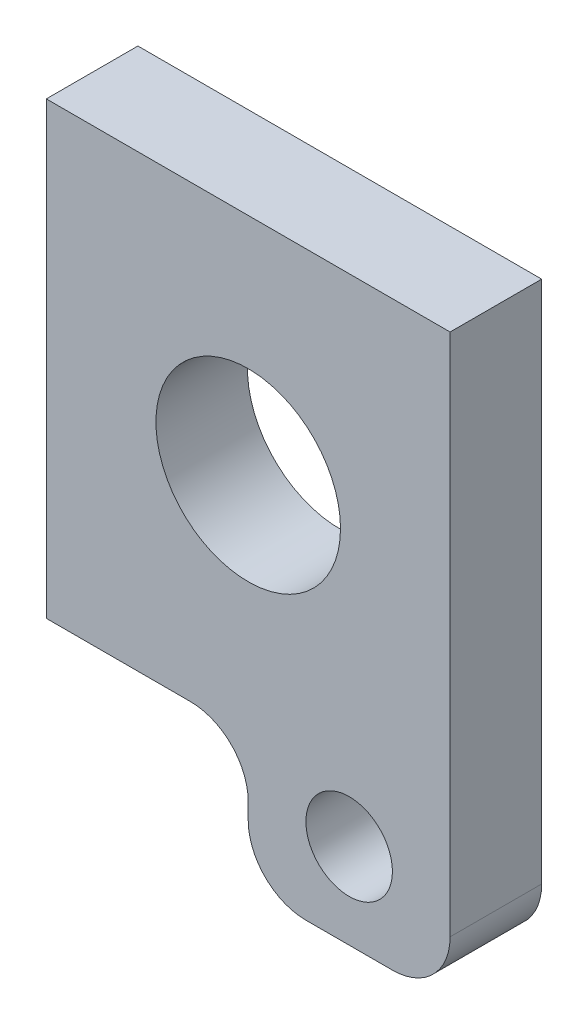
ISO-10303-21;
HEADER;
FILE_DESCRIPTION(('STEP AP214'),'2;1');
FILE_NAME('part.step','',(''),(''),'','','');
FILE_SCHEMA(('AUTOMOTIVE_DESIGN { 1 0 10303 214 1 1 1 1 }'));
ENDSEC;
DATA;
#1=APPLICATION_CONTEXT('core data for automotive mechanical design processes');
#2=APPLICATION_PROTOCOL_DEFINITION('international standard','automotive_design',2000,#1);
#3=PRODUCT_CONTEXT('',#1,'mechanical');
#4=PRODUCT('Part','Part','',(#3));
#5=PRODUCT_RELATED_PRODUCT_CATEGORY('part','',(#4));
#6=PRODUCT_DEFINITION_FORMATION('','',#4);
#7=PRODUCT_DEFINITION_CONTEXT('part definition',#1,'design');
#8=PRODUCT_DEFINITION('design','',#6,#7);
#9=PRODUCT_DEFINITION_SHAPE('','',#8);
#10=(LENGTH_UNIT() NAMED_UNIT(*) SI_UNIT(.MILLI.,.METRE.));
#11=(NAMED_UNIT(*) PLANE_ANGLE_UNIT() SI_UNIT($,.RADIAN.));
#12=(NAMED_UNIT(*) SI_UNIT($,.STERADIAN.) SOLID_ANGLE_UNIT());
#13=UNCERTAINTY_MEASURE_WITH_UNIT(LENGTH_MEASURE(1.E-05),#10,'distance_accuracy_value','');
#14=(GEOMETRIC_REPRESENTATION_CONTEXT(3) GLOBAL_UNCERTAINTY_ASSIGNED_CONTEXT((#13)) GLOBAL_UNIT_ASSIGNED_CONTEXT((#10,
#11,#12)) REPRESENTATION_CONTEXT('',''));
#15=CARTESIAN_POINT('',(0.,0.,0.));
#16=DIRECTION('',(0.,0.,1.));
#17=DIRECTION('',(1.,0.,0.));
#18=AXIS2_PLACEMENT_3D('',#15,#16,#17);
#19=CARTESIAN_POINT('',(-1.,-3.9,1.5875));
#20=DIRECTION('',(0.,-1.,0.));
#21=DIRECTION('',(0.,0.,-1.));
#22=AXIS2_PLACEMENT_3D('',#19,#20,#21);
#23=PLANE('',#22);
#24=DIRECTION('',(-1.,0.,0.));
#25=VECTOR('',#24,1.);
#26=CARTESIAN_POINT('',(-1.,-3.9,0.));
#27=LINE('',#26,#25);
#28=CARTESIAN_POINT('',(-1.,-3.9,0.));
#29=VERTEX_POINT('',#28);
#30=CARTESIAN_POINT('',(-3.5,-3.9,0.));
#31=VERTEX_POINT('',#30);
#32=EDGE_CURVE('E136',#29,#31,#27,.T.);
#33=ORIENTED_EDGE('',*,*,#32,.F.);
#34=DIRECTION('',(0.,0.,-1.));
#35=VECTOR('',#34,1.);
#36=CARTESIAN_POINT('',(-1.,-3.9,1.5875));
#37=LINE('',#36,#35);
#38=CARTESIAN_POINT('',(-1.,-3.9,1.5875));
#39=VERTEX_POINT('',#38);
#40=EDGE_CURVE('E11',#39,#29,#37,.T.);
#41=ORIENTED_EDGE('',*,*,#40,.F.);
#42=DIRECTION('',(-1.,0.,0.));
#43=VECTOR('',#42,1.);
#44=CARTESIAN_POINT('',(-1.,-3.9,1.5875));
#45=LINE('',#44,#43);
#46=CARTESIAN_POINT('',(-3.5,-3.9,1.5875));
#47=VERTEX_POINT('',#46);
#48=EDGE_CURVE('E160',#39,#47,#45,.T.);
#49=ORIENTED_EDGE('',*,*,#48,.T.);
#50=DIRECTION('',(0.,0.,-1.));
#51=VECTOR('',#50,1.);
#52=CARTESIAN_POINT('',(-3.5,-3.9,1.5875));
#53=LINE('',#52,#51);
#54=EDGE_CURVE('E36',#47,#31,#53,.T.);
#55=ORIENTED_EDGE('',*,*,#54,.T.);
#56=EDGE_LOOP('',(#33,#41,#49,#55));
#57=FACE_BOUND('',#56,.T.);
#58=ADVANCED_FACE('F33',(#57),#23,.T.);
#59=CARTESIAN_POINT('',(-1.,-4.9,1.5875));
#60=DIRECTION('',(0.,0.,-1.));
#61=DIRECTION('',(-1.,0.,0.));
#62=AXIS2_PLACEMENT_3D('',#59,#60,#61);
#63=CYLINDRICAL_SURFACE('',#62,1.);
#64=CARTESIAN_POINT('',(-1.,-4.9,0.));
#65=DIRECTION('',(0.,0.,1.));
#66=DIRECTION('',(1.,0.,0.));
#67=AXIS2_PLACEMENT_3D('',#64,#65,#66);
#68=CIRCLE('',#67,1.);
#69=CARTESIAN_POINT('',(0.,-4.9,0.));
#70=VERTEX_POINT('',#69);
#71=EDGE_CURVE('E158',#70,#29,#68,.T.);
#72=ORIENTED_EDGE('',*,*,#71,.F.);
#73=DIRECTION('',(0.,0.,-1.));
#74=VECTOR('',#73,1.);
#75=CARTESIAN_POINT('',(0.,-4.9,1.5875));
#76=LINE('',#75,#74);
#77=CARTESIAN_POINT('',(0.,-4.9,1.5875));
#78=VERTEX_POINT('',#77);
#79=EDGE_CURVE('E42',#78,#70,#76,.T.);
#80=ORIENTED_EDGE('',*,*,#79,.F.);
#81=CARTESIAN_POINT('',(-1.,-4.9,1.5875));
#82=DIRECTION('',(0.,0.,1.));
#83=DIRECTION('',(1.,0.,0.));
#84=AXIS2_PLACEMENT_3D('',#81,#82,#83);
#85=CIRCLE('',#84,1.);
#86=EDGE_CURVE('E126',#78,#39,#85,.T.);
#87=ORIENTED_EDGE('',*,*,#86,.T.);
#88=ORIENTED_EDGE('',*,*,#40,.T.);
#89=EDGE_LOOP('',(#72,#80,#87,#88));
#90=FACE_BOUND('',#89,.T.);
#91=ADVANCED_FACE('F174',(#90),#63,.F.);
#92=CARTESIAN_POINT('',(0.,-5.18125,1.5875));
#93=DIRECTION('',(-1.,0.,0.));
#94=DIRECTION('',(0.,0.,1.));
#95=AXIS2_PLACEMENT_3D('',#92,#93,#94);
#96=PLANE('',#95);
#97=DIRECTION('',(0.,1.,0.));
#98=VECTOR('',#97,1.);
#99=CARTESIAN_POINT('',(0.,-5.18125,0.));
#100=LINE('',#99,#98);
#101=CARTESIAN_POINT('',(0.,-5.18125,0.));
#102=VERTEX_POINT('',#101);
#103=EDGE_CURVE('E113',#102,#70,#100,.T.);
#104=ORIENTED_EDGE('',*,*,#103,.F.);
#105=DIRECTION('',(0.,0.,-1.));
#106=VECTOR('',#105,1.);
#107=CARTESIAN_POINT('',(0.,-5.18125,1.5875));
#108=LINE('',#107,#106);
#109=CARTESIAN_POINT('',(0.,-5.18125,1.5875));
#110=VERTEX_POINT('',#109);
#111=EDGE_CURVE('E108',#110,#102,#108,.T.);
#112=ORIENTED_EDGE('',*,*,#111,.F.);
#113=DIRECTION('',(0.,1.,0.));
#114=VECTOR('',#113,1.);
#115=CARTESIAN_POINT('',(0.,-5.18125,1.5875));
#116=LINE('',#115,#114);
#117=EDGE_CURVE('E111',#110,#78,#116,.T.);
#118=ORIENTED_EDGE('',*,*,#117,.T.);
#119=ORIENTED_EDGE('',*,*,#79,.T.);
#120=EDGE_LOOP('',(#104,#112,#118,#119));
#121=FACE_BOUND('',#120,.T.);
#122=ADVANCED_FACE('F110',(#121),#96,.T.);
#123=CARTESIAN_POINT('',(1.,-5.18125,1.5875));
#124=DIRECTION('',(0.,0.,-1.));
#125=DIRECTION('',(-1.,0.,0.));
#126=AXIS2_PLACEMENT_3D('',#123,#124,#125);
#127=CYLINDRICAL_SURFACE('',#126,1.);
#128=CARTESIAN_POINT('',(1.,-5.18125,0.));
#129=DIRECTION('',(0.,0.,-1.));
#130=DIRECTION('',(-1.,0.,0.));
#131=AXIS2_PLACEMENT_3D('',#128,#129,#130);
#132=CIRCLE('',#131,1.);
#133=CARTESIAN_POINT('',(1.,-6.18125,0.));
#134=VERTEX_POINT('',#133);
#135=EDGE_CURVE('E155',#134,#102,#132,.T.);
#136=ORIENTED_EDGE('',*,*,#135,.F.);
#137=DIRECTION('',(0.,0.,-1.));
#138=VECTOR('',#137,1.);
#139=CARTESIAN_POINT('',(1.,-6.18125,1.5875));
#140=LINE('',#139,#138);
#141=CARTESIAN_POINT('',(1.,-6.18125,1.5875));
#142=VERTEX_POINT('',#141);
#143=EDGE_CURVE('E118',#142,#134,#140,.T.);
#144=ORIENTED_EDGE('',*,*,#143,.F.);
#145=CARTESIAN_POINT('',(1.,-5.18125,1.5875));
#146=DIRECTION('',(0.,0.,-1.));
#147=DIRECTION('',(-1.,0.,0.));
#148=AXIS2_PLACEMENT_3D('',#145,#146,#147);
#149=CIRCLE('',#148,1.);
#150=EDGE_CURVE('E124',#142,#110,#149,.T.);
#151=ORIENTED_EDGE('',*,*,#150,.T.);
#152=ORIENTED_EDGE('',*,*,#111,.T.);
#153=EDGE_LOOP('',(#136,#144,#151,#152));
#154=FACE_BOUND('',#153,.T.);
#155=ADVANCED_FACE('F128',(#154),#127,.T.);
#156=CARTESIAN_POINT('',(2.5,-6.18125,1.5875));
#157=DIRECTION('',(0.,-1.,0.));
#158=DIRECTION('',(0.,0.,-1.));
#159=AXIS2_PLACEMENT_3D('',#156,#157,#158);
#160=PLANE('',#159);
#161=DIRECTION('',(-1.,0.,0.));
#162=VECTOR('',#161,1.);
#163=CARTESIAN_POINT('',(2.5,-6.18125,0.));
#164=LINE('',#163,#162);
#165=CARTESIAN_POINT('',(2.5,-6.18125,0.));
#166=VERTEX_POINT('',#165);
#167=EDGE_CURVE('E152',#166,#134,#164,.T.);
#168=ORIENTED_EDGE('',*,*,#167,.F.);
#169=DIRECTION('',(0.,0.,-1.));
#170=VECTOR('',#169,1.);
#171=CARTESIAN_POINT('',(2.5,-6.18125,1.5875));
#172=LINE('',#171,#170);
#173=CARTESIAN_POINT('',(2.5,-6.18125,1.5875));
#174=VERTEX_POINT('',#173);
#175=EDGE_CURVE('E164',#174,#166,#172,.T.);
#176=ORIENTED_EDGE('',*,*,#175,.F.);
#177=DIRECTION('',(-1.,0.,0.));
#178=VECTOR('',#177,1.);
#179=CARTESIAN_POINT('',(2.5,-6.18125,1.5875));
#180=LINE('',#179,#178);
#181=EDGE_CURVE('E129',#174,#142,#180,.T.);
#182=ORIENTED_EDGE('',*,*,#181,.T.);
#183=ORIENTED_EDGE('',*,*,#143,.T.);
#184=EDGE_LOOP('',(#168,#176,#182,#183));
#185=FACE_BOUND('',#184,.T.);
#186=ADVANCED_FACE('F187',(#185),#160,.T.);
#187=CARTESIAN_POINT('',(2.5,-5.18125,1.5875));
#188=DIRECTION('',(0.,0.,-1.));
#189=DIRECTION('',(-1.,0.,0.));
#190=AXIS2_PLACEMENT_3D('',#187,#188,#189);
#191=CYLINDRICAL_SURFACE('',#190,1.);
#192=CARTESIAN_POINT('',(2.5,-5.18125,0.));
#193=DIRECTION('',(0.,0.,-1.));
#194=DIRECTION('',(-1.,0.,0.));
#195=AXIS2_PLACEMENT_3D('',#192,#193,#194);
#196=CIRCLE('',#195,1.);
#197=CARTESIAN_POINT('',(3.5,-5.18125,0.));
#198=VERTEX_POINT('',#197);
#199=EDGE_CURVE('E149',#198,#166,#196,.T.);
#200=ORIENTED_EDGE('',*,*,#199,.F.);
#201=DIRECTION('',(0.,0.,-1.));
#202=VECTOR('',#201,1.);
#203=CARTESIAN_POINT('',(3.5,-5.18125,1.5875));
#204=LINE('',#203,#202);
#205=CARTESIAN_POINT('',(3.5,-5.18125,1.5875));
#206=VERTEX_POINT('',#205);
#207=EDGE_CURVE('E166',#206,#198,#204,.T.);
#208=ORIENTED_EDGE('',*,*,#207,.F.);
#209=CARTESIAN_POINT('',(2.5,-5.18125,1.5875));
#210=DIRECTION('',(0.,0.,-1.));
#211=DIRECTION('',(-1.,0.,0.));
#212=AXIS2_PLACEMENT_3D('',#209,#210,#211);
#213=CIRCLE('',#212,1.);
#214=EDGE_CURVE('E131',#206,#174,#213,.T.);
#215=ORIENTED_EDGE('',*,*,#214,.T.);
#216=ORIENTED_EDGE('',*,*,#175,.T.);
#217=EDGE_LOOP('',(#200,#208,#215,#216));
#218=FACE_BOUND('',#217,.T.);
#219=ADVANCED_FACE('F190',(#218),#191,.T.);
#220=CARTESIAN_POINT('',(3.5,3.9,1.5875));
#221=DIRECTION('',(1.,0.,0.));
#222=DIRECTION('',(0.,0.,-1.));
#223=AXIS2_PLACEMENT_3D('',#220,#221,#222);
#224=PLANE('',#223);
#225=DIRECTION('',(0.,-1.,0.));
#226=VECTOR('',#225,1.);
#227=CARTESIAN_POINT('',(3.5,3.9,0.));
#228=LINE('',#227,#226);
#229=CARTESIAN_POINT('',(3.5,3.9,0.));
#230=VERTEX_POINT('',#229);
#231=EDGE_CURVE('E146',#230,#198,#228,.T.);
#232=ORIENTED_EDGE('',*,*,#231,.F.);
#233=DIRECTION('',(0.,0.,-1.));
#234=VECTOR('',#233,1.);
#235=CARTESIAN_POINT('',(3.5,3.9,1.5875));
#236=LINE('',#235,#234);
#237=CARTESIAN_POINT('',(3.5,3.9,1.5875));
#238=VERTEX_POINT('',#237);
#239=EDGE_CURVE('E168',#238,#230,#236,.T.);
#240=ORIENTED_EDGE('',*,*,#239,.F.);
#241=DIRECTION('',(0.,-1.,0.));
#242=VECTOR('',#241,1.);
#243=CARTESIAN_POINT('',(3.5,3.9,1.5875));
#244=LINE('',#243,#242);
#245=EDGE_CURVE('E243',#238,#206,#244,.T.);
#246=ORIENTED_EDGE('',*,*,#245,.T.);
#247=ORIENTED_EDGE('',*,*,#207,.T.);
#248=EDGE_LOOP('',(#232,#240,#246,#247));
#249=FACE_BOUND('',#248,.T.);
#250=ADVANCED_FACE('F194',(#249),#224,.T.);
#251=CARTESIAN_POINT('',(-3.5,3.9,1.5875));
#252=DIRECTION('',(0.,1.,0.));
#253=DIRECTION('',(-1.,0.,0.));
#254=AXIS2_PLACEMENT_3D('',#251,#252,#253);
#255=PLANE('',#254);
#256=DIRECTION('',(1.,0.,0.));
#257=VECTOR('',#256,1.);
#258=CARTESIAN_POINT('',(-3.5,3.9,0.));
#259=LINE('',#258,#257);
#260=CARTESIAN_POINT('',(-3.5,3.9,0.));
#261=VERTEX_POINT('',#260);
#262=EDGE_CURVE('E143',#261,#230,#259,.T.);
#263=ORIENTED_EDGE('',*,*,#262,.F.);
#264=DIRECTION('',(0.,0.,-1.));
#265=VECTOR('',#264,1.);
#266=CARTESIAN_POINT('',(-3.5,3.9,1.5875));
#267=LINE('',#266,#265);
#268=CARTESIAN_POINT('',(-3.5,3.9,1.5875));
#269=VERTEX_POINT('',#268);
#270=EDGE_CURVE('E169',#269,#261,#267,.T.);
#271=ORIENTED_EDGE('',*,*,#270,.F.);
#272=DIRECTION('',(1.,0.,0.));
#273=VECTOR('',#272,1.);
#274=CARTESIAN_POINT('',(-3.5,3.9,1.5875));
#275=LINE('',#274,#273);
#276=EDGE_CURVE('E240',#269,#238,#275,.T.);
#277=ORIENTED_EDGE('',*,*,#276,.T.);
#278=ORIENTED_EDGE('',*,*,#239,.T.);
#279=EDGE_LOOP('',(#263,#271,#277,#278));
#280=FACE_BOUND('',#279,.T.);
#281=ADVANCED_FACE('F198',(#280),#255,.T.);
#282=CARTESIAN_POINT('',(-3.5,-3.9,1.5875));
#283=DIRECTION('',(-1.,0.,0.));
#284=DIRECTION('',(0.,-1.,0.));
#285=AXIS2_PLACEMENT_3D('',#282,#283,#284);
#286=PLANE('',#285);
#287=DIRECTION('',(0.,1.,0.));
#288=VECTOR('',#287,1.);
#289=CARTESIAN_POINT('',(-3.5,-3.9,0.));
#290=LINE('',#289,#288);
#291=EDGE_CURVE('E139',#31,#261,#290,.T.);
#292=ORIENTED_EDGE('',*,*,#291,.F.);
#293=ORIENTED_EDGE('',*,*,#54,.F.);
#294=DIRECTION('',(0.,1.,0.));
#295=VECTOR('',#294,1.);
#296=CARTESIAN_POINT('',(-3.5,-3.9,1.5875));
#297=LINE('',#296,#295);
#298=EDGE_CURVE('E238',#47,#269,#297,.T.);
#299=ORIENTED_EDGE('',*,*,#298,.T.);
#300=ORIENTED_EDGE('',*,*,#270,.T.);
#301=EDGE_LOOP('',(#292,#293,#299,#300));
#302=FACE_BOUND('',#301,.T.);
#303=ADVANCED_FACE('F171',(#302),#286,.T.);
#304=CARTESIAN_POINT('',(2.5,-5.18125,1.5875));
#305=DIRECTION('',(0.,0.,-1.));
#306=DIRECTION('',(-1.,0.,0.));
#307=AXIS2_PLACEMENT_3D('',#304,#305,#306);
#308=PLANE('',#307);
#309=CARTESIAN_POINT('',(0.,0.,1.5875));
#310=DIRECTION('',(0.,0.,-1.));
#311=DIRECTION('',(1.,0.,0.));
#312=AXIS2_PLACEMENT_3D('',#309,#310,#311);
#313=CIRCLE('',#312,1.6);
#314=CARTESIAN_POINT('',(1.6,0.,1.5875));
#315=VERTEX_POINT('',#314);
#316=EDGE_CURVE('E225',#315,#315,#313,.T.);
#317=ORIENTED_EDGE('',*,*,#316,.T.);
#318=EDGE_LOOP('',(#317));
#319=FACE_BOUND('',#318,.T.);
#320=CARTESIAN_POINT('',(1.75,-4.7,1.5875));
#321=DIRECTION('',(0.,0.,-1.));
#322=DIRECTION('',(1.,0.,0.));
#323=AXIS2_PLACEMENT_3D('',#320,#321,#322);
#324=CIRCLE('',#323,0.75);
#325=CARTESIAN_POINT('',(2.5,-4.7,1.5875));
#326=VERTEX_POINT('',#325);
#327=EDGE_CURVE('E140',#326,#326,#324,.T.);
#328=ORIENTED_EDGE('',*,*,#327,.T.);
#329=EDGE_LOOP('',(#328));
#330=FACE_BOUND('',#329,.T.);
#331=ORIENTED_EDGE('',*,*,#48,.F.);
#332=ORIENTED_EDGE('',*,*,#86,.F.);
#333=ORIENTED_EDGE('',*,*,#117,.F.);
#334=ORIENTED_EDGE('',*,*,#150,.F.);
#335=ORIENTED_EDGE('',*,*,#181,.F.);
#336=ORIENTED_EDGE('',*,*,#214,.F.);
#337=ORIENTED_EDGE('',*,*,#245,.F.);
#338=ORIENTED_EDGE('',*,*,#276,.F.);
#339=ORIENTED_EDGE('',*,*,#298,.F.);
#340=EDGE_LOOP('',(#331,#332,#333,#334,#335,#336,#337,#338,#339));
#341=FACE_BOUND('',#340,.T.);
#342=ADVANCED_FACE('F122',(#319,#330,#341),#308,.F.);
#343=CARTESIAN_POINT('',(2.5,-5.18125,0.));
#344=DIRECTION('',(0.,0.,-1.));
#345=DIRECTION('',(-1.,0.,0.));
#346=AXIS2_PLACEMENT_3D('',#343,#344,#345);
#347=PLANE('',#346);
#348=CARTESIAN_POINT('',(0.,0.,0.));
#349=DIRECTION('',(0.,0.,-1.));
#350=DIRECTION('',(1.,0.,0.));
#351=AXIS2_PLACEMENT_3D('',#348,#349,#350);
#352=CIRCLE('',#351,1.6);
#353=CARTESIAN_POINT('',(1.6,0.,0.));
#354=VERTEX_POINT('',#353);
#355=EDGE_CURVE('E228',#354,#354,#352,.T.);
#356=ORIENTED_EDGE('',*,*,#355,.F.);
#357=EDGE_LOOP('',(#356));
#358=FACE_BOUND('',#357,.T.);
#359=CARTESIAN_POINT('',(1.75,-4.7,0.));
#360=DIRECTION('',(0.,0.,-1.));
#361=DIRECTION('',(1.,0.,0.));
#362=AXIS2_PLACEMENT_3D('',#359,#360,#361);
#363=CIRCLE('',#362,0.75);
#364=CARTESIAN_POINT('',(2.5,-4.7,0.));
#365=VERTEX_POINT('',#364);
#366=EDGE_CURVE('E230',#365,#365,#363,.T.);
#367=ORIENTED_EDGE('',*,*,#366,.F.);
#368=EDGE_LOOP('',(#367));
#369=FACE_BOUND('',#368,.T.);
#370=ORIENTED_EDGE('',*,*,#32,.T.);
#371=ORIENTED_EDGE('',*,*,#291,.T.);
#372=ORIENTED_EDGE('',*,*,#262,.T.);
#373=ORIENTED_EDGE('',*,*,#231,.T.);
#374=ORIENTED_EDGE('',*,*,#199,.T.);
#375=ORIENTED_EDGE('',*,*,#167,.T.);
#376=ORIENTED_EDGE('',*,*,#135,.T.);
#377=ORIENTED_EDGE('',*,*,#103,.T.);
#378=ORIENTED_EDGE('',*,*,#71,.T.);
#379=EDGE_LOOP('',(#370,#371,#372,#373,#374,#375,#376,#377,#378));
#380=FACE_BOUND('',#379,.T.);
#381=ADVANCED_FACE('F173',(#358,#369,#380),#347,.T.);
#382=CARTESIAN_POINT('',(1.75,-4.7,1.5875));
#383=DIRECTION('',(0.,0.,-1.));
#384=DIRECTION('',(-1.,0.,0.));
#385=AXIS2_PLACEMENT_3D('',#382,#383,#384);
#386=CYLINDRICAL_SURFACE('',#385,0.75);
#387=ORIENTED_EDGE('',*,*,#327,.F.);
#388=EDGE_LOOP('',(#387));
#389=FACE_BOUND('',#388,.T.);
#390=ORIENTED_EDGE('',*,*,#366,.T.);
#391=EDGE_LOOP('',(#390));
#392=FACE_BOUND('',#391,.T.);
#393=ADVANCED_FACE('F210',(#389,#392),#386,.F.);
#394=CARTESIAN_POINT('',(0.,0.,1.5875));
#395=DIRECTION('',(0.,0.,-1.));
#396=DIRECTION('',(-1.,0.,0.));
#397=AXIS2_PLACEMENT_3D('',#394,#395,#396);
#398=CYLINDRICAL_SURFACE('',#397,1.6);
#399=ORIENTED_EDGE('',*,*,#316,.F.);
#400=EDGE_LOOP('',(#399));
#401=FACE_BOUND('',#400,.T.);
#402=ORIENTED_EDGE('',*,*,#355,.T.);
#403=EDGE_LOOP('',(#402));
#404=FACE_BOUND('',#403,.T.);
#405=ADVANCED_FACE('F217',(#401,#404),#398,.F.);
#406=CLOSED_SHELL('',(#58,#91,#122,#155,#186,#219,#250,#281,#303,#342,#381,#393,#405));
#407=MANIFOLD_SOLID_BREP('B2',#406);
#408=ADVANCED_BREP_SHAPE_REPRESENTATION('',(#18,#407),#14);
#409=SHAPE_DEFINITION_REPRESENTATION(#9,#408);
ENDSEC;
END-ISO-10303-21;
